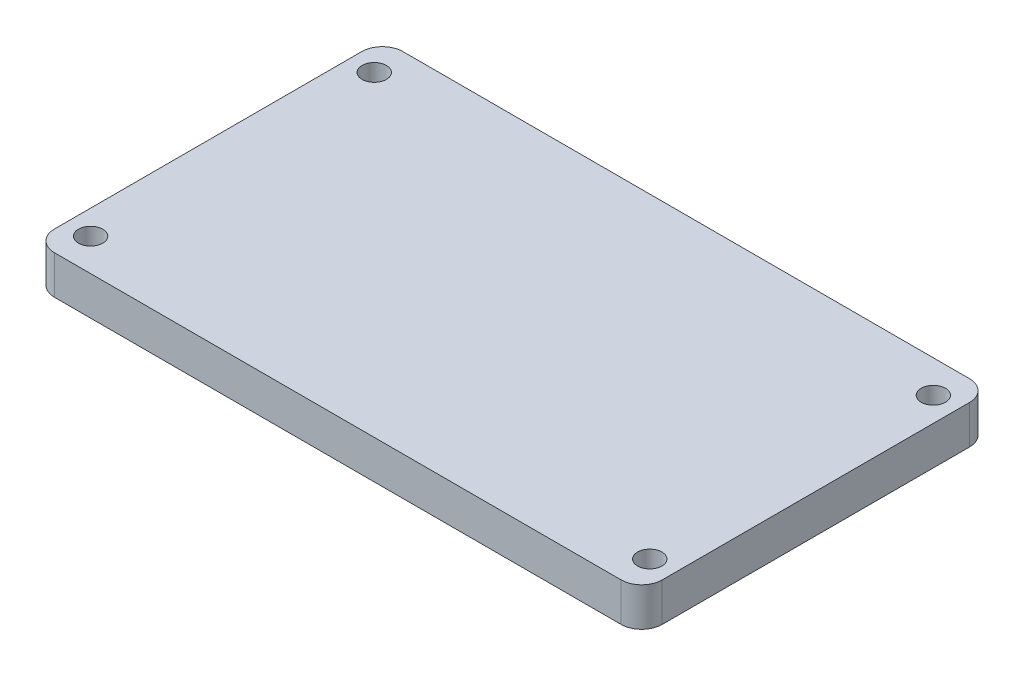
ISO-10303-21;
HEADER;
FILE_DESCRIPTION(('STEP AP214'),'2;1');
FILE_NAME('part.step','',(''),(''),'','','');
FILE_SCHEMA(('AUTOMOTIVE_DESIGN { 1 0 10303 214 1 1 1 1 }'));
ENDSEC;
DATA;
#1=APPLICATION_CONTEXT('core data for automotive mechanical design processes');
#2=APPLICATION_PROTOCOL_DEFINITION('international standard','automotive_design',2000,#1);
#3=PRODUCT_CONTEXT('',#1,'mechanical');
#4=PRODUCT('Part','Part','',(#3));
#5=PRODUCT_RELATED_PRODUCT_CATEGORY('part','',(#4));
#6=PRODUCT_DEFINITION_FORMATION('','',#4);
#7=PRODUCT_DEFINITION_CONTEXT('part definition',#1,'design');
#8=PRODUCT_DEFINITION('design','',#6,#7);
#9=PRODUCT_DEFINITION_SHAPE('','',#8);
#10=(LENGTH_UNIT() NAMED_UNIT(*) SI_UNIT(.MILLI.,.METRE.));
#11=(NAMED_UNIT(*) PLANE_ANGLE_UNIT() SI_UNIT($,.RADIAN.));
#12=(NAMED_UNIT(*) SI_UNIT($,.STERADIAN.) SOLID_ANGLE_UNIT());
#13=UNCERTAINTY_MEASURE_WITH_UNIT(LENGTH_MEASURE(1.E-05),#10,'distance_accuracy_value','');
#14=(GEOMETRIC_REPRESENTATION_CONTEXT(3) GLOBAL_UNCERTAINTY_ASSIGNED_CONTEXT((#13)) GLOBAL_UNIT_ASSIGNED_CONTEXT((#10,
#11,#12)) REPRESENTATION_CONTEXT('',''));
#15=CARTESIAN_POINT('',(0.,0.,0.));
#16=DIRECTION('',(0.,0.,1.));
#17=DIRECTION('',(1.,0.,0.));
#18=AXIS2_PLACEMENT_3D('',#15,#16,#17);
#19=CARTESIAN_POINT('',(34.96,4.7625,-18.96));
#20=DIRECTION('',(0.,-1.,0.));
#21=DIRECTION('',(0.,0.,-1.));
#22=AXIS2_PLACEMENT_3D('',#19,#20,#21);
#23=PLANE('',#22);
#24=CARTESIAN_POINT('',(34.96,4.7625,-18.96));
#25=DIRECTION('',(0.,1.,0.));
#26=DIRECTION('',(0.,0.,-1.));
#27=AXIS2_PLACEMENT_3D('',#24,#25,#26);
#28=CIRCLE('',#27,2.54);
#29=CARTESIAN_POINT('',(37.5,4.7625,-18.96));
#30=VERTEX_POINT('',#29);
#31=CARTESIAN_POINT('',(34.96,4.7625,-21.5));
#32=VERTEX_POINT('',#31);
#33=EDGE_CURVE('E147',#30,#32,#28,.T.);
#34=ORIENTED_EDGE('',*,*,#33,.T.);
#35=DIRECTION('',(-1.,0.,0.));
#36=VECTOR('',#35,1.);
#37=CARTESIAN_POINT('',(-34.96,4.7625,-21.5));
#38=LINE('',#37,#36);
#39=CARTESIAN_POINT('',(-34.96,4.7625,-21.5));
#40=VERTEX_POINT('',#39);
#41=EDGE_CURVE('E95',#32,#40,#38,.T.);
#42=ORIENTED_EDGE('',*,*,#41,.T.);
#43=CARTESIAN_POINT('',(-34.96,4.7625,-18.96));
#44=DIRECTION('',(0.,1.,0.));
#45=DIRECTION('',(0.,0.,-1.));
#46=AXIS2_PLACEMENT_3D('',#43,#44,#45);
#47=CIRCLE('',#46,2.54);
#48=CARTESIAN_POINT('',(-37.5,4.7625,-18.96));
#49=VERTEX_POINT('',#48);
#50=EDGE_CURVE('E162',#40,#49,#47,.T.);
#51=ORIENTED_EDGE('',*,*,#50,.T.);
#52=DIRECTION('',(0.,0.,1.));
#53=VECTOR('',#52,1.);
#54=CARTESIAN_POINT('',(-37.5,4.7625,18.96));
#55=LINE('',#54,#53);
#56=CARTESIAN_POINT('',(-37.5,4.7625,18.96));
#57=VERTEX_POINT('',#56);
#58=EDGE_CURVE('E175',#49,#57,#55,.T.);
#59=ORIENTED_EDGE('',*,*,#58,.T.);
#60=CARTESIAN_POINT('',(-34.96,4.7625,18.96));
#61=DIRECTION('',(0.,1.,0.));
#62=DIRECTION('',(0.,0.,-1.));
#63=AXIS2_PLACEMENT_3D('',#60,#61,#62);
#64=CIRCLE('',#63,2.54);
#65=CARTESIAN_POINT('',(-34.96,4.7625,21.5));
#66=VERTEX_POINT('',#65);
#67=EDGE_CURVE('E114',#57,#66,#64,.T.);
#68=ORIENTED_EDGE('',*,*,#67,.T.);
#69=DIRECTION('',(1.,0.,0.));
#70=VECTOR('',#69,1.);
#71=CARTESIAN_POINT('',(-34.96,4.7625,21.5));
#72=LINE('',#71,#70);
#73=CARTESIAN_POINT('',(34.96,4.7625,21.5));
#74=VERTEX_POINT('',#73);
#75=EDGE_CURVE('E108',#66,#74,#72,.T.);
#76=ORIENTED_EDGE('',*,*,#75,.T.);
#77=CARTESIAN_POINT('',(34.96,4.7625,18.96));
#78=DIRECTION('',(0.,1.,0.));
#79=DIRECTION('',(0.,0.,-1.));
#80=AXIS2_PLACEMENT_3D('',#77,#78,#79);
#81=CIRCLE('',#80,2.54);
#82=CARTESIAN_POINT('',(37.5,4.7625,18.96));
#83=VERTEX_POINT('',#82);
#84=EDGE_CURVE('E112',#74,#83,#81,.T.);
#85=ORIENTED_EDGE('',*,*,#84,.T.);
#86=DIRECTION('',(0.,0.,-1.));
#87=VECTOR('',#86,1.);
#88=CARTESIAN_POINT('',(37.5,4.7625,18.96));
#89=LINE('',#88,#87);
#90=EDGE_CURVE('E52',#83,#30,#89,.T.);
#91=ORIENTED_EDGE('',*,*,#90,.T.);
#92=EDGE_LOOP('',(#34,#42,#51,#59,#68,#76,#85,#91));
#93=FACE_BOUND('',#92,.T.);
#94=CARTESIAN_POINT('',(-34.5,4.7625,17.5));
#95=DIRECTION('',(0.,1.,0.));
#96=DIRECTION('',(0.,0.,1.));
#97=AXIS2_PLACEMENT_3D('',#94,#95,#96);
#98=CIRCLE('',#97,1.5);
#99=CARTESIAN_POINT('',(-34.5,4.7625,19.));
#100=VERTEX_POINT('',#99);
#101=EDGE_CURVE('E136',#100,#100,#98,.T.);
#102=ORIENTED_EDGE('',*,*,#101,.F.);
#103=EDGE_LOOP('',(#102));
#104=FACE_BOUND('',#103,.T.);
#105=CARTESIAN_POINT('',(-34.5,4.7625,-17.5));
#106=DIRECTION('',(0.,1.,0.));
#107=DIRECTION('',(0.,0.,1.));
#108=AXIS2_PLACEMENT_3D('',#105,#106,#107);
#109=CIRCLE('',#108,1.5);
#110=CARTESIAN_POINT('',(-34.5,4.7625,-16.));
#111=VERTEX_POINT('',#110);
#112=EDGE_CURVE('E184',#111,#111,#109,.T.);
#113=ORIENTED_EDGE('',*,*,#112,.F.);
#114=EDGE_LOOP('',(#113));
#115=FACE_BOUND('',#114,.T.);
#116=CARTESIAN_POINT('',(34.5,4.7625,17.5));
#117=DIRECTION('',(0.,1.,0.));
#118=DIRECTION('',(0.,0.,1.));
#119=AXIS2_PLACEMENT_3D('',#116,#117,#118);
#120=CIRCLE('',#119,1.5);
#121=CARTESIAN_POINT('',(34.5,4.7625,19.));
#122=VERTEX_POINT('',#121);
#123=EDGE_CURVE('E190',#122,#122,#120,.T.);
#124=ORIENTED_EDGE('',*,*,#123,.F.);
#125=EDGE_LOOP('',(#124));
#126=FACE_BOUND('',#125,.T.);
#127=CARTESIAN_POINT('',(34.5,4.7625,-17.5));
#128=DIRECTION('',(0.,1.,0.));
#129=DIRECTION('',(0.,0.,1.));
#130=AXIS2_PLACEMENT_3D('',#127,#128,#129);
#131=CIRCLE('',#130,1.5);
#132=CARTESIAN_POINT('',(34.5,4.7625,-16.));
#133=VERTEX_POINT('',#132);
#134=EDGE_CURVE('E196',#133,#133,#131,.T.);
#135=ORIENTED_EDGE('',*,*,#134,.F.);
#136=EDGE_LOOP('',(#135));
#137=FACE_BOUND('',#136,.T.);
#138=ADVANCED_FACE('F35',(#93,#104,#115,#126,#137),#23,.F.);
#139=CARTESIAN_POINT('',(34.96,0.,-18.96));
#140=DIRECTION('',(0.,-1.,0.));
#141=DIRECTION('',(0.,0.,-1.));
#142=AXIS2_PLACEMENT_3D('',#139,#140,#141);
#143=PLANE('',#142);
#144=CARTESIAN_POINT('',(34.5,0.,17.5));
#145=DIRECTION('',(0.,1.,0.));
#146=DIRECTION('',(0.,0.,1.));
#147=AXIS2_PLACEMENT_3D('',#144,#145,#146);
#148=CIRCLE('',#147,1.5);
#149=CARTESIAN_POINT('',(34.5,0.,19.));
#150=VERTEX_POINT('',#149);
#151=EDGE_CURVE('E193',#150,#150,#148,.T.);
#152=ORIENTED_EDGE('',*,*,#151,.T.);
#153=EDGE_LOOP('',(#152));
#154=FACE_BOUND('',#153,.T.);
#155=CARTESIAN_POINT('',(-34.5,0.,17.5));
#156=DIRECTION('',(0.,1.,0.));
#157=DIRECTION('',(0.,0.,1.));
#158=AXIS2_PLACEMENT_3D('',#155,#156,#157);
#159=CIRCLE('',#158,1.5);
#160=CARTESIAN_POINT('',(-34.5,0.,19.));
#161=VERTEX_POINT('',#160);
#162=EDGE_CURVE('E181',#161,#161,#159,.T.);
#163=ORIENTED_EDGE('',*,*,#162,.T.);
#164=EDGE_LOOP('',(#163));
#165=FACE_BOUND('',#164,.T.);
#166=CARTESIAN_POINT('',(34.96,0.,-18.96));
#167=DIRECTION('',(0.,1.,0.));
#168=DIRECTION('',(0.,0.,-1.));
#169=AXIS2_PLACEMENT_3D('',#166,#167,#168);
#170=CIRCLE('',#169,2.54);
#171=CARTESIAN_POINT('',(37.5,0.,-18.96));
#172=VERTEX_POINT('',#171);
#173=CARTESIAN_POINT('',(34.96,0.,-21.5));
#174=VERTEX_POINT('',#173);
#175=EDGE_CURVE('E132',#172,#174,#170,.T.);
#176=ORIENTED_EDGE('',*,*,#175,.F.);
#177=DIRECTION('',(0.,0.,-1.));
#178=VECTOR('',#177,1.);
#179=CARTESIAN_POINT('',(37.5,0.,18.96));
#180=LINE('',#179,#178);
#181=CARTESIAN_POINT('',(37.5,0.,18.96));
#182=VERTEX_POINT('',#181);
#183=EDGE_CURVE('E87',#182,#172,#180,.T.);
#184=ORIENTED_EDGE('',*,*,#183,.F.);
#185=CARTESIAN_POINT('',(34.96,0.,18.96));
#186=DIRECTION('',(0.,1.,0.));
#187=DIRECTION('',(0.,0.,-1.));
#188=AXIS2_PLACEMENT_3D('',#185,#186,#187);
#189=CIRCLE('',#188,2.54);
#190=CARTESIAN_POINT('',(34.96,0.,21.5));
#191=VERTEX_POINT('',#190);
#192=EDGE_CURVE('E81',#191,#182,#189,.T.);
#193=ORIENTED_EDGE('',*,*,#192,.F.);
#194=DIRECTION('',(1.,0.,0.));
#195=VECTOR('',#194,1.);
#196=CARTESIAN_POINT('',(-34.96,0.,21.5));
#197=LINE('',#196,#195);
#198=CARTESIAN_POINT('',(-34.96,0.,21.5));
#199=VERTEX_POINT('',#198);
#200=EDGE_CURVE('E122',#199,#191,#197,.T.);
#201=ORIENTED_EDGE('',*,*,#200,.F.);
#202=CARTESIAN_POINT('',(-34.96,0.,18.96));
#203=DIRECTION('',(0.,1.,0.));
#204=DIRECTION('',(0.,0.,-1.));
#205=AXIS2_PLACEMENT_3D('',#202,#203,#204);
#206=CIRCLE('',#205,2.54);
#207=CARTESIAN_POINT('',(-37.5,0.,18.96));
#208=VERTEX_POINT('',#207);
#209=EDGE_CURVE('E142',#208,#199,#206,.T.);
#210=ORIENTED_EDGE('',*,*,#209,.F.);
#211=DIRECTION('',(0.,0.,1.));
#212=VECTOR('',#211,1.);
#213=CARTESIAN_POINT('',(-37.5,0.,18.96));
#214=LINE('',#213,#212);
#215=CARTESIAN_POINT('',(-37.5,0.,-18.96));
#216=VERTEX_POINT('',#215);
#217=EDGE_CURVE('E140',#216,#208,#214,.T.);
#218=ORIENTED_EDGE('',*,*,#217,.F.);
#219=CARTESIAN_POINT('',(-34.96,0.,-18.96));
#220=DIRECTION('',(0.,1.,0.));
#221=DIRECTION('',(0.,0.,-1.));
#222=AXIS2_PLACEMENT_3D('',#219,#220,#221);
#223=CIRCLE('',#222,2.54);
#224=CARTESIAN_POINT('',(-34.96,0.,-21.5));
#225=VERTEX_POINT('',#224);
#226=EDGE_CURVE('E138',#225,#216,#223,.T.);
#227=ORIENTED_EDGE('',*,*,#226,.F.);
#228=DIRECTION('',(-1.,0.,0.));
#229=VECTOR('',#228,1.);
#230=CARTESIAN_POINT('',(-34.96,0.,-21.5));
#231=LINE('',#230,#229);
#232=EDGE_CURVE('E135',#174,#225,#231,.T.);
#233=ORIENTED_EDGE('',*,*,#232,.F.);
#234=EDGE_LOOP('',(#176,#184,#193,#201,#210,#218,#227,#233));
#235=FACE_BOUND('',#234,.T.);
#236=CARTESIAN_POINT('',(-34.5,0.,-17.5));
#237=DIRECTION('',(0.,1.,0.));
#238=DIRECTION('',(0.,0.,1.));
#239=AXIS2_PLACEMENT_3D('',#236,#237,#238);
#240=CIRCLE('',#239,1.5);
#241=CARTESIAN_POINT('',(-34.5,0.,-16.));
#242=VERTEX_POINT('',#241);
#243=EDGE_CURVE('E187',#242,#242,#240,.T.);
#244=ORIENTED_EDGE('',*,*,#243,.T.);
#245=EDGE_LOOP('',(#244));
#246=FACE_BOUND('',#245,.T.);
#247=CARTESIAN_POINT('',(34.5,0.,-17.5));
#248=DIRECTION('',(0.,1.,0.));
#249=DIRECTION('',(0.,0.,1.));
#250=AXIS2_PLACEMENT_3D('',#247,#248,#249);
#251=CIRCLE('',#250,1.5);
#252=CARTESIAN_POINT('',(34.5,0.,-16.));
#253=VERTEX_POINT('',#252);
#254=EDGE_CURVE('E199',#253,#253,#251,.T.);
#255=ORIENTED_EDGE('',*,*,#254,.T.);
#256=EDGE_LOOP('',(#255));
#257=FACE_BOUND('',#256,.T.);
#258=ADVANCED_FACE('F166',(#154,#165,#235,#246,#257),#143,.T.);
#259=CARTESIAN_POINT('',(34.96,4.7625,-18.96));
#260=DIRECTION('',(0.,-1.,0.));
#261=DIRECTION('',(0.,0.,-1.));
#262=AXIS2_PLACEMENT_3D('',#259,#260,#261);
#263=CYLINDRICAL_SURFACE('',#262,2.54);
#264=ORIENTED_EDGE('',*,*,#175,.T.);
#265=DIRECTION('',(0.,-1.,0.));
#266=VECTOR('',#265,1.);
#267=CARTESIAN_POINT('',(34.96,4.7625,-21.5));
#268=LINE('',#267,#266);
#269=EDGE_CURVE('E11',#32,#174,#268,.T.);
#270=ORIENTED_EDGE('',*,*,#269,.F.);
#271=ORIENTED_EDGE('',*,*,#33,.F.);
#272=DIRECTION('',(0.,-1.,0.));
#273=VECTOR('',#272,1.);
#274=CARTESIAN_POINT('',(37.5,4.7625,-18.96));
#275=LINE('',#274,#273);
#276=EDGE_CURVE('E128',#30,#172,#275,.T.);
#277=ORIENTED_EDGE('',*,*,#276,.T.);
#278=EDGE_LOOP('',(#264,#270,#271,#277));
#279=FACE_BOUND('',#278,.T.);
#280=ADVANCED_FACE('F37',(#279),#263,.T.);
#281=CARTESIAN_POINT('',(-34.96,4.7625,-21.5));
#282=DIRECTION('',(0.,0.,1.));
#283=DIRECTION('',(1.,0.,0.));
#284=AXIS2_PLACEMENT_3D('',#281,#282,#283);
#285=PLANE('',#284);
#286=ORIENTED_EDGE('',*,*,#232,.T.);
#287=DIRECTION('',(0.,-1.,0.));
#288=VECTOR('',#287,1.);
#289=CARTESIAN_POINT('',(-34.96,4.7625,-21.5));
#290=LINE('',#289,#288);
#291=EDGE_CURVE('E44',#40,#225,#290,.T.);
#292=ORIENTED_EDGE('',*,*,#291,.F.);
#293=ORIENTED_EDGE('',*,*,#41,.F.);
#294=ORIENTED_EDGE('',*,*,#269,.T.);
#295=EDGE_LOOP('',(#286,#292,#293,#294));
#296=FACE_BOUND('',#295,.T.);
#297=ADVANCED_FACE('F231',(#296),#285,.F.);
#298=CARTESIAN_POINT('',(-34.96,4.7625,-18.96));
#299=DIRECTION('',(0.,-1.,0.));
#300=DIRECTION('',(0.,0.,-1.));
#301=AXIS2_PLACEMENT_3D('',#298,#299,#300);
#302=CYLINDRICAL_SURFACE('',#301,2.54);
#303=ORIENTED_EDGE('',*,*,#226,.T.);
#304=DIRECTION('',(0.,-1.,0.));
#305=VECTOR('',#304,1.);
#306=CARTESIAN_POINT('',(-37.5,4.7625,-18.96));
#307=LINE('',#306,#305);
#308=EDGE_CURVE('E154',#49,#216,#307,.T.);
#309=ORIENTED_EDGE('',*,*,#308,.F.);
#310=ORIENTED_EDGE('',*,*,#50,.F.);
#311=ORIENTED_EDGE('',*,*,#291,.T.);
#312=EDGE_LOOP('',(#303,#309,#310,#311));
#313=FACE_BOUND('',#312,.T.);
#314=ADVANCED_FACE('F160',(#313),#302,.T.);
#315=CARTESIAN_POINT('',(-37.5,4.7625,18.96));
#316=DIRECTION('',(1.,0.,0.));
#317=DIRECTION('',(0.,0.,-1.));
#318=AXIS2_PLACEMENT_3D('',#315,#316,#317);
#319=PLANE('',#318);
#320=ORIENTED_EDGE('',*,*,#217,.T.);
#321=DIRECTION('',(0.,-1.,0.));
#322=VECTOR('',#321,1.);
#323=CARTESIAN_POINT('',(-37.5,4.7625,18.96));
#324=LINE('',#323,#322);
#325=EDGE_CURVE('E151',#57,#208,#324,.T.);
#326=ORIENTED_EDGE('',*,*,#325,.F.);
#327=ORIENTED_EDGE('',*,*,#58,.F.);
#328=ORIENTED_EDGE('',*,*,#308,.T.);
#329=EDGE_LOOP('',(#320,#326,#327,#328));
#330=FACE_BOUND('',#329,.T.);
#331=ADVANCED_FACE('F171',(#330),#319,.F.);
#332=CARTESIAN_POINT('',(-34.96,4.7625,18.96));
#333=DIRECTION('',(0.,-1.,0.));
#334=DIRECTION('',(0.,0.,-1.));
#335=AXIS2_PLACEMENT_3D('',#332,#333,#334);
#336=CYLINDRICAL_SURFACE('',#335,2.54);
#337=ORIENTED_EDGE('',*,*,#209,.T.);
#338=DIRECTION('',(0.,-1.,0.));
#339=VECTOR('',#338,1.);
#340=CARTESIAN_POINT('',(-34.96,4.7625,21.5));
#341=LINE('',#340,#339);
#342=EDGE_CURVE('E123',#66,#199,#341,.T.);
#343=ORIENTED_EDGE('',*,*,#342,.F.);
#344=ORIENTED_EDGE('',*,*,#67,.F.);
#345=ORIENTED_EDGE('',*,*,#325,.T.);
#346=EDGE_LOOP('',(#337,#343,#344,#345));
#347=FACE_BOUND('',#346,.T.);
#348=ADVANCED_FACE('F174',(#347),#336,.T.);
#349=CARTESIAN_POINT('',(-34.96,4.7625,21.5));
#350=DIRECTION('',(0.,0.,-1.));
#351=DIRECTION('',(-1.,0.,0.));
#352=AXIS2_PLACEMENT_3D('',#349,#350,#351);
#353=PLANE('',#352);
#354=ORIENTED_EDGE('',*,*,#200,.T.);
#355=DIRECTION('',(0.,-1.,0.));
#356=VECTOR('',#355,1.);
#357=CARTESIAN_POINT('',(34.96,4.7625,21.5));
#358=LINE('',#357,#356);
#359=EDGE_CURVE('E119',#74,#191,#358,.T.);
#360=ORIENTED_EDGE('',*,*,#359,.F.);
#361=ORIENTED_EDGE('',*,*,#75,.F.);
#362=ORIENTED_EDGE('',*,*,#342,.T.);
#363=EDGE_LOOP('',(#354,#360,#361,#362));
#364=FACE_BOUND('',#363,.T.);
#365=ADVANCED_FACE('F120',(#364),#353,.F.);
#366=CARTESIAN_POINT('',(34.96,4.7625,18.96));
#367=DIRECTION('',(0.,-1.,0.));
#368=DIRECTION('',(0.,0.,-1.));
#369=AXIS2_PLACEMENT_3D('',#366,#367,#368);
#370=CYLINDRICAL_SURFACE('',#369,2.54);
#371=ORIENTED_EDGE('',*,*,#192,.T.);
#372=DIRECTION('',(0.,-1.,0.));
#373=VECTOR('',#372,1.);
#374=CARTESIAN_POINT('',(37.5,4.7625,18.96));
#375=LINE('',#374,#373);
#376=EDGE_CURVE('E124',#83,#182,#375,.T.);
#377=ORIENTED_EDGE('',*,*,#376,.F.);
#378=ORIENTED_EDGE('',*,*,#84,.F.);
#379=ORIENTED_EDGE('',*,*,#359,.T.);
#380=EDGE_LOOP('',(#371,#377,#378,#379));
#381=FACE_BOUND('',#380,.T.);
#382=ADVANCED_FACE('F126',(#381),#370,.T.);
#383=CARTESIAN_POINT('',(37.5,4.7625,18.96));
#384=DIRECTION('',(-1.,0.,0.));
#385=DIRECTION('',(0.,0.,1.));
#386=AXIS2_PLACEMENT_3D('',#383,#384,#385);
#387=PLANE('',#386);
#388=ORIENTED_EDGE('',*,*,#183,.T.);
#389=ORIENTED_EDGE('',*,*,#276,.F.);
#390=ORIENTED_EDGE('',*,*,#90,.F.);
#391=ORIENTED_EDGE('',*,*,#376,.T.);
#392=EDGE_LOOP('',(#388,#389,#390,#391));
#393=FACE_BOUND('',#392,.T.);
#394=ADVANCED_FACE('F219',(#393),#387,.F.);
#395=CARTESIAN_POINT('',(-34.5,4.7625,17.5));
#396=DIRECTION('',(0.,-1.,0.));
#397=DIRECTION('',(0.,0.,-1.));
#398=AXIS2_PLACEMENT_3D('',#395,#396,#397);
#399=CYLINDRICAL_SURFACE('',#398,1.5);
#400=ORIENTED_EDGE('',*,*,#101,.T.);
#401=EDGE_LOOP('',(#400));
#402=FACE_BOUND('',#401,.T.);
#403=ORIENTED_EDGE('',*,*,#162,.F.);
#404=EDGE_LOOP('',(#403));
#405=FACE_BOUND('',#404,.T.);
#406=ADVANCED_FACE('F216',(#402,#405),#399,.F.);
#407=CARTESIAN_POINT('',(-34.5,4.7625,-17.5));
#408=DIRECTION('',(0.,-1.,0.));
#409=DIRECTION('',(0.,0.,-1.));
#410=AXIS2_PLACEMENT_3D('',#407,#408,#409);
#411=CYLINDRICAL_SURFACE('',#410,1.5);
#412=ORIENTED_EDGE('',*,*,#112,.T.);
#413=EDGE_LOOP('',(#412));
#414=FACE_BOUND('',#413,.T.);
#415=ORIENTED_EDGE('',*,*,#243,.F.);
#416=EDGE_LOOP('',(#415));
#417=FACE_BOUND('',#416,.T.);
#418=ADVANCED_FACE('F295',(#414,#417),#411,.F.);
#419=CARTESIAN_POINT('',(34.5,4.7625,17.5));
#420=DIRECTION('',(0.,-1.,0.));
#421=DIRECTION('',(0.,0.,-1.));
#422=AXIS2_PLACEMENT_3D('',#419,#420,#421);
#423=CYLINDRICAL_SURFACE('',#422,1.5);
#424=ORIENTED_EDGE('',*,*,#123,.T.);
#425=EDGE_LOOP('',(#424));
#426=FACE_BOUND('',#425,.T.);
#427=ORIENTED_EDGE('',*,*,#151,.F.);
#428=EDGE_LOOP('',(#427));
#429=FACE_BOUND('',#428,.T.);
#430=ADVANCED_FACE('F303',(#426,#429),#423,.F.);
#431=CARTESIAN_POINT('',(34.5,4.7625,-17.5));
#432=DIRECTION('',(0.,-1.,0.));
#433=DIRECTION('',(0.,0.,-1.));
#434=AXIS2_PLACEMENT_3D('',#431,#432,#433);
#435=CYLINDRICAL_SURFACE('',#434,1.5);
#436=ORIENTED_EDGE('',*,*,#134,.T.);
#437=EDGE_LOOP('',(#436));
#438=FACE_BOUND('',#437,.T.);
#439=ORIENTED_EDGE('',*,*,#254,.F.);
#440=EDGE_LOOP('',(#439));
#441=FACE_BOUND('',#440,.T.);
#442=ADVANCED_FACE('F205',(#438,#441),#435,.F.);
#443=CLOSED_SHELL('',(#138,#258,#280,#297,#314,#331,#348,#365,#382,#394,#406,#418,#430,#442));
#444=MANIFOLD_SOLID_BREP('B2',#443);
#445=ADVANCED_BREP_SHAPE_REPRESENTATION('',(#18,#444),#14);
#446=SHAPE_DEFINITION_REPRESENTATION(#9,#445);
ENDSEC;
END-ISO-10303-21;
